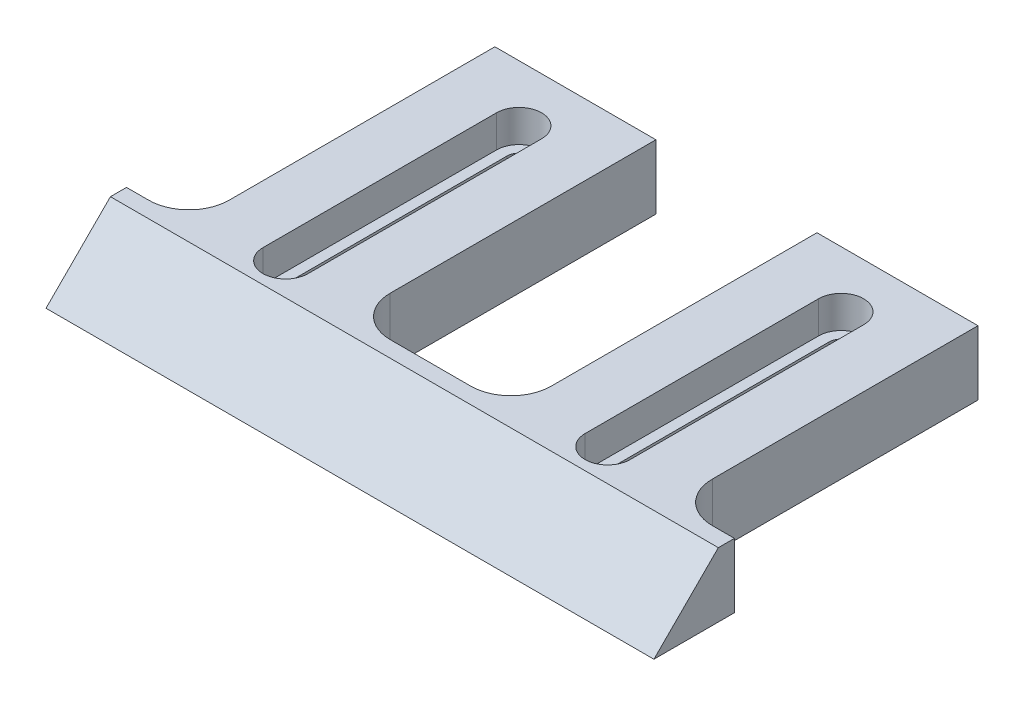
ISO-10303-21;
HEADER;
FILE_DESCRIPTION(('STEP AP214'),'2;1');
FILE_NAME('part.step','',(''),(''),'','','');
FILE_SCHEMA(('AUTOMOTIVE_DESIGN { 1 0 10303 214 1 1 1 1 }'));
ENDSEC;
DATA;
#1=APPLICATION_CONTEXT('core data for automotive mechanical design processes');
#2=APPLICATION_PROTOCOL_DEFINITION('international standard','automotive_design',2000,#1);
#3=PRODUCT_CONTEXT('',#1,'mechanical');
#4=PRODUCT('Part','Part','',(#3));
#5=PRODUCT_RELATED_PRODUCT_CATEGORY('part','',(#4));
#6=PRODUCT_DEFINITION_FORMATION('','',#4);
#7=PRODUCT_DEFINITION_CONTEXT('part definition',#1,'design');
#8=PRODUCT_DEFINITION('design','',#6,#7);
#9=PRODUCT_DEFINITION_SHAPE('','',#8);
#10=(LENGTH_UNIT() NAMED_UNIT(*) SI_UNIT(.MILLI.,.METRE.));
#11=(NAMED_UNIT(*) PLANE_ANGLE_UNIT() SI_UNIT($,.RADIAN.));
#12=(NAMED_UNIT(*) SI_UNIT($,.STERADIAN.) SOLID_ANGLE_UNIT());
#13=UNCERTAINTY_MEASURE_WITH_UNIT(LENGTH_MEASURE(1.E-05),#10,'distance_accuracy_value','');
#14=(GEOMETRIC_REPRESENTATION_CONTEXT(3) GLOBAL_UNCERTAINTY_ASSIGNED_CONTEXT((#13)) GLOBAL_UNIT_ASSIGNED_CONTEXT((#10,
#11,#12)) REPRESENTATION_CONTEXT('',''));
#15=CARTESIAN_POINT('',(0.,0.,0.));
#16=DIRECTION('',(0.,0.,1.));
#17=DIRECTION('',(1.,0.,0.));
#18=AXIS2_PLACEMENT_3D('',#15,#16,#17);
#19=CARTESIAN_POINT('',(57.75,-0.000999999999999265,-43.));
#20=DIRECTION('',(0.,1.,0.));
#21=DIRECTION('',(0.,0.,1.));
#22=AXIS2_PLACEMENT_3D('',#19,#20,#21);
#23=CYLINDRICAL_SURFACE('',#22,1.5);
#24=CARTESIAN_POINT('',(57.75,4.,-43.));
#25=DIRECTION('',(0.,1.,0.));
#26=DIRECTION('',(0.,0.,1.));
#27=AXIS2_PLACEMENT_3D('',#24,#25,#26);
#28=CIRCLE('',#27,1.5);
#29=CARTESIAN_POINT('',(56.25,4.,-43.));
#30=VERTEX_POINT('',#29);
#31=CARTESIAN_POINT('',(59.25,4.,-43.));
#32=VERTEX_POINT('',#31);
#33=EDGE_CURVE('E283',#30,#32,#28,.F.);
#34=ORIENTED_EDGE('',*,*,#33,.F.);
#35=DIRECTION('',(0.,1.,0.));
#36=VECTOR('',#35,1.);
#37=CARTESIAN_POINT('',(56.25,-0.000999999999999265,-43.));
#38=LINE('',#37,#36);
#39=CARTESIAN_POINT('',(56.25,0.,-43.));
#40=VERTEX_POINT('',#39);
#41=EDGE_CURVE('E366',#40,#30,#38,.T.);
#42=ORIENTED_EDGE('',*,*,#41,.F.);
#43=CARTESIAN_POINT('',(57.75,0.,-43.));
#44=DIRECTION('',(0.,-1.,0.));
#45=DIRECTION('',(0.,0.,-1.));
#46=AXIS2_PLACEMENT_3D('',#43,#44,#45);
#47=CIRCLE('',#46,1.5);
#48=CARTESIAN_POINT('',(59.25,0.,-43.));
#49=VERTEX_POINT('',#48);
#50=EDGE_CURVE('E363',#49,#40,#47,.F.);
#51=ORIENTED_EDGE('',*,*,#50,.F.);
#52=DIRECTION('',(0.,1.,0.));
#53=VECTOR('',#52,1.);
#54=CARTESIAN_POINT('',(59.25,-0.000999999999999265,-43.));
#55=LINE('',#54,#53);
#56=EDGE_CURVE('E367',#49,#32,#55,.T.);
#57=ORIENTED_EDGE('',*,*,#56,.T.);
#58=EDGE_LOOP('',(#34,#42,#51,#57));
#59=FACE_BOUND('',#58,.T.);
#60=ADVANCED_FACE('F34',(#59),#23,.F.);
#61=CARTESIAN_POINT('',(59.25,-0.000999999999999265,-43.));
#62=DIRECTION('',(1.,0.,0.));
#63=DIRECTION('',(0.,0.,-1.));
#64=AXIS2_PLACEMENT_3D('',#61,#62,#63);
#65=PLANE('',#64);
#66=DIRECTION('',(0.,0.,1.));
#67=VECTOR('',#66,1.);
#68=CARTESIAN_POINT('',(59.25,4.,-43.));
#69=LINE('',#68,#67);
#70=CARTESIAN_POINT('',(59.25,4.,-14.));
#71=VERTEX_POINT('',#70);
#72=EDGE_CURVE('E281',#32,#71,#69,.T.);
#73=ORIENTED_EDGE('',*,*,#72,.F.);
#74=ORIENTED_EDGE('',*,*,#56,.F.);
#75=DIRECTION('',(0.,0.,-1.));
#76=VECTOR('',#75,1.);
#77=CARTESIAN_POINT('',(59.25,0.,-43.));
#78=LINE('',#77,#76);
#79=CARTESIAN_POINT('',(59.25,0.,-14.));
#80=VERTEX_POINT('',#79);
#81=EDGE_CURVE('E360',#80,#49,#78,.T.);
#82=ORIENTED_EDGE('',*,*,#81,.F.);
#83=DIRECTION('',(0.,1.,0.));
#84=VECTOR('',#83,1.);
#85=CARTESIAN_POINT('',(59.25,-0.000999999999999265,-14.));
#86=LINE('',#85,#84);
#87=EDGE_CURVE('E371',#80,#71,#86,.T.);
#88=ORIENTED_EDGE('',*,*,#87,.T.);
#89=EDGE_LOOP('',(#73,#74,#82,#88));
#90=FACE_BOUND('',#89,.T.);
#91=ADVANCED_FACE('F514',(#90),#65,.F.);
#92=CARTESIAN_POINT('',(57.75,-0.000999999999999265,-14.));
#93=DIRECTION('',(0.,1.,0.));
#94=DIRECTION('',(0.,0.,1.));
#95=AXIS2_PLACEMENT_3D('',#92,#93,#94);
#96=CYLINDRICAL_SURFACE('',#95,1.5);
#97=CARTESIAN_POINT('',(57.75,4.,-14.));
#98=DIRECTION('',(0.,1.,0.));
#99=DIRECTION('',(0.,0.,1.));
#100=AXIS2_PLACEMENT_3D('',#97,#98,#99);
#101=CIRCLE('',#100,1.5);
#102=CARTESIAN_POINT('',(56.25,4.,-14.));
#103=VERTEX_POINT('',#102);
#104=EDGE_CURVE('E56',#71,#103,#101,.F.);
#105=ORIENTED_EDGE('',*,*,#104,.F.);
#106=ORIENTED_EDGE('',*,*,#87,.F.);
#107=CARTESIAN_POINT('',(57.75,0.,-14.));
#108=DIRECTION('',(0.,-1.,0.));
#109=DIRECTION('',(0.,0.,-1.));
#110=AXIS2_PLACEMENT_3D('',#107,#108,#109);
#111=CIRCLE('',#110,1.5);
#112=CARTESIAN_POINT('',(56.25,0.,-14.));
#113=VERTEX_POINT('',#112);
#114=EDGE_CURVE('E355',#113,#80,#111,.F.);
#115=ORIENTED_EDGE('',*,*,#114,.F.);
#116=DIRECTION('',(0.,1.,0.));
#117=VECTOR('',#116,1.);
#118=CARTESIAN_POINT('',(56.25,-0.000999999999999265,-14.));
#119=LINE('',#118,#117);
#120=EDGE_CURVE('E374',#113,#103,#119,.T.);
#121=ORIENTED_EDGE('',*,*,#120,.T.);
#122=EDGE_LOOP('',(#105,#106,#115,#121));
#123=FACE_BOUND('',#122,.T.);
#124=ADVANCED_FACE('F520',(#123),#96,.F.);
#125=CARTESIAN_POINT('',(56.25,-0.000999999999999265,-43.));
#126=DIRECTION('',(-1.,0.,0.));
#127=DIRECTION('',(0.,0.,1.));
#128=AXIS2_PLACEMENT_3D('',#125,#126,#127);
#129=PLANE('',#128);
#130=DIRECTION('',(0.,0.,-1.));
#131=VECTOR('',#130,1.);
#132=CARTESIAN_POINT('',(56.25,4.,-43.));
#133=LINE('',#132,#131);
#134=EDGE_CURVE('E11',#103,#30,#133,.T.);
#135=ORIENTED_EDGE('',*,*,#134,.F.);
#136=ORIENTED_EDGE('',*,*,#120,.F.);
#137=DIRECTION('',(0.,0.,1.));
#138=VECTOR('',#137,1.);
#139=CARTESIAN_POINT('',(56.25,0.,-43.));
#140=LINE('',#139,#138);
#141=EDGE_CURVE('E370',#40,#113,#140,.T.);
#142=ORIENTED_EDGE('',*,*,#141,.F.);
#143=ORIENTED_EDGE('',*,*,#41,.T.);
#144=EDGE_LOOP('',(#135,#136,#142,#143));
#145=FACE_BOUND('',#144,.T.);
#146=ADVANCED_FACE('F525',(#145),#129,.F.);
#147=CARTESIAN_POINT('',(17.75,-0.000999999999999265,-43.));
#148=DIRECTION('',(0.,1.,0.));
#149=DIRECTION('',(0.,0.,1.));
#150=AXIS2_PLACEMENT_3D('',#147,#148,#149);
#151=CYLINDRICAL_SURFACE('',#150,1.5);
#152=CARTESIAN_POINT('',(17.75,4.,-43.));
#153=DIRECTION('',(0.,1.,0.));
#154=DIRECTION('',(0.,0.,1.));
#155=AXIS2_PLACEMENT_3D('',#152,#153,#154);
#156=CIRCLE('',#155,1.5);
#157=CARTESIAN_POINT('',(16.25,4.,-43.));
#158=VERTEX_POINT('',#157);
#159=CARTESIAN_POINT('',(19.25,4.,-43.));
#160=VERTEX_POINT('',#159);
#161=EDGE_CURVE('E321',#158,#160,#156,.F.);
#162=ORIENTED_EDGE('',*,*,#161,.F.);
#163=DIRECTION('',(0.,1.,0.));
#164=VECTOR('',#163,1.);
#165=CARTESIAN_POINT('',(16.25,-0.000999999999999265,-43.));
#166=LINE('',#165,#164);
#167=CARTESIAN_POINT('',(16.25,0.,-43.));
#168=VERTEX_POINT('',#167);
#169=EDGE_CURVE('E390',#168,#158,#166,.T.);
#170=ORIENTED_EDGE('',*,*,#169,.F.);
#171=CARTESIAN_POINT('',(17.75,0.,-43.));
#172=DIRECTION('',(0.,-1.,0.));
#173=DIRECTION('',(0.,0.,-1.));
#174=AXIS2_PLACEMENT_3D('',#171,#172,#173);
#175=CIRCLE('',#174,1.5);
#176=CARTESIAN_POINT('',(19.25,0.,-43.));
#177=VERTEX_POINT('',#176);
#178=EDGE_CURVE('E387',#177,#168,#175,.F.);
#179=ORIENTED_EDGE('',*,*,#178,.F.);
#180=DIRECTION('',(0.,1.,0.));
#181=VECTOR('',#180,1.);
#182=CARTESIAN_POINT('',(19.25,-0.000999999999999265,-43.));
#183=LINE('',#182,#181);
#184=EDGE_CURVE('E391',#177,#160,#183,.T.);
#185=ORIENTED_EDGE('',*,*,#184,.T.);
#186=EDGE_LOOP('',(#162,#170,#179,#185));
#187=FACE_BOUND('',#186,.T.);
#188=ADVANCED_FACE('F493',(#187),#151,.F.);
#189=CARTESIAN_POINT('',(19.25,-0.000999999999999265,-43.));
#190=DIRECTION('',(1.,0.,0.));
#191=DIRECTION('',(0.,0.,-1.));
#192=AXIS2_PLACEMENT_3D('',#189,#190,#191);
#193=PLANE('',#192);
#194=DIRECTION('',(0.,0.,1.));
#195=VECTOR('',#194,1.);
#196=CARTESIAN_POINT('',(19.25,4.,-43.));
#197=LINE('',#196,#195);
#198=CARTESIAN_POINT('',(19.25,4.,-14.));
#199=VERTEX_POINT('',#198);
#200=EDGE_CURVE('E319',#160,#199,#197,.T.);
#201=ORIENTED_EDGE('',*,*,#200,.F.);
#202=ORIENTED_EDGE('',*,*,#184,.F.);
#203=DIRECTION('',(0.,0.,-1.));
#204=VECTOR('',#203,1.);
#205=CARTESIAN_POINT('',(19.25,0.,-43.));
#206=LINE('',#205,#204);
#207=CARTESIAN_POINT('',(19.25,0.,-14.));
#208=VERTEX_POINT('',#207);
#209=EDGE_CURVE('E384',#208,#177,#206,.T.);
#210=ORIENTED_EDGE('',*,*,#209,.F.);
#211=DIRECTION('',(0.,1.,0.));
#212=VECTOR('',#211,1.);
#213=CARTESIAN_POINT('',(19.25,-0.000999999999999265,-14.));
#214=LINE('',#213,#212);
#215=EDGE_CURVE('E395',#208,#199,#214,.T.);
#216=ORIENTED_EDGE('',*,*,#215,.T.);
#217=EDGE_LOOP('',(#201,#202,#210,#216));
#218=FACE_BOUND('',#217,.T.);
#219=ADVANCED_FACE('F500',(#218),#193,.F.);
#220=CARTESIAN_POINT('',(17.75,-0.000999999999999265,-14.));
#221=DIRECTION('',(0.,1.,0.));
#222=DIRECTION('',(0.,0.,1.));
#223=AXIS2_PLACEMENT_3D('',#220,#221,#222);
#224=CYLINDRICAL_SURFACE('',#223,1.5);
#225=CARTESIAN_POINT('',(17.75,4.,-14.));
#226=DIRECTION('',(0.,1.,0.));
#227=DIRECTION('',(0.,0.,1.));
#228=AXIS2_PLACEMENT_3D('',#225,#226,#227);
#229=CIRCLE('',#228,1.5);
#230=CARTESIAN_POINT('',(16.25,4.,-14.));
#231=VERTEX_POINT('',#230);
#232=EDGE_CURVE('E311',#199,#231,#229,.F.);
#233=ORIENTED_EDGE('',*,*,#232,.F.);
#234=ORIENTED_EDGE('',*,*,#215,.F.);
#235=CARTESIAN_POINT('',(17.75,0.,-14.));
#236=DIRECTION('',(0.,-1.,0.));
#237=DIRECTION('',(0.,0.,-1.));
#238=AXIS2_PLACEMENT_3D('',#235,#236,#237);
#239=CIRCLE('',#238,1.5);
#240=CARTESIAN_POINT('',(16.25,0.,-14.));
#241=VERTEX_POINT('',#240);
#242=EDGE_CURVE('E381',#241,#208,#239,.F.);
#243=ORIENTED_EDGE('',*,*,#242,.F.);
#244=DIRECTION('',(0.,1.,0.));
#245=VECTOR('',#244,1.);
#246=CARTESIAN_POINT('',(16.25,-0.000999999999999265,-14.));
#247=LINE('',#246,#245);
#248=EDGE_CURVE('E398',#241,#231,#247,.T.);
#249=ORIENTED_EDGE('',*,*,#248,.T.);
#250=EDGE_LOOP('',(#233,#234,#243,#249));
#251=FACE_BOUND('',#250,.T.);
#252=ADVANCED_FACE('F503',(#251),#224,.F.);
#253=CARTESIAN_POINT('',(16.25,-0.000999999999999265,-43.));
#254=DIRECTION('',(-1.,0.,0.));
#255=DIRECTION('',(0.,0.,1.));
#256=AXIS2_PLACEMENT_3D('',#253,#254,#255);
#257=PLANE('',#256);
#258=DIRECTION('',(0.,0.,-1.));
#259=VECTOR('',#258,1.);
#260=CARTESIAN_POINT('',(16.25,4.,-43.));
#261=LINE('',#260,#259);
#262=EDGE_CURVE('E42',#231,#158,#261,.T.);
#263=ORIENTED_EDGE('',*,*,#262,.F.);
#264=ORIENTED_EDGE('',*,*,#248,.F.);
#265=DIRECTION('',(0.,0.,1.));
#266=VECTOR('',#265,1.);
#267=CARTESIAN_POINT('',(16.25,0.,-43.));
#268=LINE('',#267,#266);
#269=EDGE_CURVE('E394',#168,#241,#268,.T.);
#270=ORIENTED_EDGE('',*,*,#269,.F.);
#271=ORIENTED_EDGE('',*,*,#169,.T.);
#272=EDGE_LOOP('',(#263,#264,#270,#271));
#273=FACE_BOUND('',#272,.T.);
#274=ADVANCED_FACE('F495',(#273),#257,.F.);
#275=CARTESIAN_POINT('',(0.,8.,-50.));
#276=DIRECTION('',(0.,0.,1.));
#277=DIRECTION('',(1.,0.,0.));
#278=AXIS2_PLACEMENT_3D('',#275,#276,#277);
#279=PLANE('',#278);
#280=DIRECTION('',(-1.,0.,0.));
#281=VECTOR('',#280,1.);
#282=CARTESIAN_POINT('',(0.,0.,-50.));
#283=LINE('',#282,#281);
#284=CARTESIAN_POINT('',(27.75,0.,-50.));
#285=VERTEX_POINT('',#284);
#286=CARTESIAN_POINT('',(7.75,0.,-50.));
#287=VERTEX_POINT('',#286);
#288=EDGE_CURVE('E418',#285,#287,#283,.T.);
#289=ORIENTED_EDGE('',*,*,#288,.T.);
#290=DIRECTION('',(0.,1.,0.));
#291=VECTOR('',#290,1.);
#292=CARTESIAN_POINT('',(7.75,-2.,-50.));
#293=LINE('',#292,#291);
#294=CARTESIAN_POINT('',(7.75,8.,-50.));
#295=VERTEX_POINT('',#294);
#296=EDGE_CURVE('E340',#287,#295,#293,.T.);
#297=ORIENTED_EDGE('',*,*,#296,.T.);
#298=DIRECTION('',(-1.,0.,0.));
#299=VECTOR('',#298,1.);
#300=CARTESIAN_POINT('',(0.,8.,-50.));
#301=LINE('',#300,#299);
#302=CARTESIAN_POINT('',(27.75,8.,-50.));
#303=VERTEX_POINT('',#302);
#304=EDGE_CURVE('E408',#303,#295,#301,.T.);
#305=ORIENTED_EDGE('',*,*,#304,.F.);
#306=DIRECTION('',(0.,1.,0.));
#307=VECTOR('',#306,1.);
#308=CARTESIAN_POINT('',(27.75,-2.,-50.));
#309=LINE('',#308,#307);
#310=EDGE_CURVE('E353',#285,#303,#309,.T.);
#311=ORIENTED_EDGE('',*,*,#310,.F.);
#312=EDGE_LOOP('',(#289,#297,#305,#311));
#313=FACE_BOUND('',#312,.T.);
#314=ADVANCED_FACE('F510',(#313),#279,.F.);
#315=CARTESIAN_POINT('',(75.5,8.,-50.));
#316=DIRECTION('',(-1.,0.,0.));
#317=DIRECTION('',(0.,0.,1.));
#318=AXIS2_PLACEMENT_3D('',#315,#316,#317);
#319=PLANE('',#318);
#320=DIRECTION('',(0.,0.,-1.));
#321=VECTOR('',#320,1.);
#322=CARTESIAN_POINT('',(75.5,8.,-50.));
#323=LINE('',#322,#321);
#324=CARTESIAN_POINT('',(75.5,8.,-10.0000000000002));
#325=VERTEX_POINT('',#324);
#326=CARTESIAN_POINT('',(75.5,8.,-12.));
#327=VERTEX_POINT('',#326);
#328=EDGE_CURVE('E406',#325,#327,#323,.T.);
#329=ORIENTED_EDGE('',*,*,#328,.F.);
#330=DIRECTION('',(0.,0.707106781186544,-0.707106781186551));
#331=VECTOR('',#330,1.);
#332=CARTESIAN_POINT('',(75.5,8.00000000000015,-10.0000000000003));
#333=LINE('',#332,#331);
#334=CARTESIAN_POINT('',(75.5,0.,-2.00000000000024));
#335=VERTEX_POINT('',#334);
#336=EDGE_CURVE('E479',#325,#335,#333,.F.);
#337=ORIENTED_EDGE('',*,*,#336,.T.);
#338=DIRECTION('',(0.,0.,-1.));
#339=VECTOR('',#338,1.);
#340=CARTESIAN_POINT('',(75.5,0.,-50.));
#341=LINE('',#340,#339);
#342=CARTESIAN_POINT('',(75.5,0.,-12.));
#343=VERTEX_POINT('',#342);
#344=EDGE_CURVE('E405',#335,#343,#341,.T.);
#345=ORIENTED_EDGE('',*,*,#344,.T.);
#346=DIRECTION('',(0.,1.,0.));
#347=VECTOR('',#346,1.);
#348=CARTESIAN_POINT('',(75.5,-2.,-12.));
#349=LINE('',#348,#347);
#350=EDGE_CURVE('E329',#343,#327,#349,.T.);
#351=ORIENTED_EDGE('',*,*,#350,.T.);
#352=EDGE_LOOP('',(#329,#337,#345,#351));
#353=FACE_BOUND('',#352,.T.);
#354=ADVANCED_FACE('F775',(#353),#319,.F.);
#355=CARTESIAN_POINT('',(67.75,8.,-50.));
#356=VERTEX_POINT('',#355);
#357=CARTESIAN_POINT('',(47.75,8.,-50.));
#358=VERTEX_POINT('',#357);
#359=EDGE_CURVE('E410',#356,#358,#301,.T.);
#360=ORIENTED_EDGE('',*,*,#359,.F.);
#361=DIRECTION('',(0.,1.,0.));
#362=VECTOR('',#361,1.);
#363=CARTESIAN_POINT('',(67.75,-2.,-50.));
#364=LINE('',#363,#362);
#365=CARTESIAN_POINT('',(67.75,0.,-50.));
#366=VERTEX_POINT('',#365);
#367=EDGE_CURVE('E330',#366,#356,#364,.T.);
#368=ORIENTED_EDGE('',*,*,#367,.F.);
#369=CARTESIAN_POINT('',(47.75,0.,-50.));
#370=VERTEX_POINT('',#369);
#371=EDGE_CURVE('E419',#366,#370,#283,.T.);
#372=ORIENTED_EDGE('',*,*,#371,.T.);
#373=DIRECTION('',(0.,1.,0.));
#374=VECTOR('',#373,1.);
#375=CARTESIAN_POINT('',(47.75,-2.,-50.));
#376=LINE('',#375,#374);
#377=EDGE_CURVE('E352',#370,#358,#376,.T.);
#378=ORIENTED_EDGE('',*,*,#377,.T.);
#379=EDGE_LOOP('',(#360,#368,#372,#378));
#380=FACE_BOUND('',#379,.T.);
#381=ADVANCED_FACE('F778',(#380),#279,.F.);
#382=CARTESIAN_POINT('',(0.,8.,0.));
#383=DIRECTION('',(1.,0.,0.));
#384=DIRECTION('',(0.,0.,-1.));
#385=AXIS2_PLACEMENT_3D('',#382,#383,#384);
#386=PLANE('',#385);
#387=DIRECTION('',(0.,0.,1.));
#388=VECTOR('',#387,1.);
#389=CARTESIAN_POINT('',(0.,0.,0.));
#390=LINE('',#389,#388);
#391=CARTESIAN_POINT('',(0.,0.,-12.));
#392=VERTEX_POINT('',#391);
#393=CARTESIAN_POINT('',(0.,0.,-2.00000000000037));
#394=VERTEX_POINT('',#393);
#395=EDGE_CURVE('E409',#392,#394,#390,.T.);
#396=ORIENTED_EDGE('',*,*,#395,.T.);
#397=DIRECTION('',(0.,-0.707106781186544,0.707106781186551));
#398=VECTOR('',#397,1.);
#399=CARTESIAN_POINT('',(0.,8.,-10.0000000000005));
#400=LINE('',#399,#398);
#401=CARTESIAN_POINT('',(0.,8.,-10.0000000000005));
#402=VERTEX_POINT('',#401);
#403=EDGE_CURVE('E483',#394,#402,#400,.F.);
#404=ORIENTED_EDGE('',*,*,#403,.T.);
#405=DIRECTION('',(0.,0.,1.));
#406=VECTOR('',#405,1.);
#407=CARTESIAN_POINT('',(0.,8.,0.));
#408=LINE('',#407,#406);
#409=CARTESIAN_POINT('',(0.,8.,-12.));
#410=VERTEX_POINT('',#409);
#411=EDGE_CURVE('E413',#410,#402,#408,.T.);
#412=ORIENTED_EDGE('',*,*,#411,.F.);
#413=DIRECTION('',(0.,1.,0.));
#414=VECTOR('',#413,1.);
#415=CARTESIAN_POINT('',(0.,-2.,-12.));
#416=LINE('',#415,#414);
#417=EDGE_CURVE('E339',#392,#410,#416,.T.);
#418=ORIENTED_EDGE('',*,*,#417,.F.);
#419=EDGE_LOOP('',(#396,#404,#412,#418));
#420=FACE_BOUND('',#419,.T.);
#421=ADVANCED_FACE('F793',(#420),#386,.F.);
#422=CARTESIAN_POINT('',(0.,8.,0.));
#423=DIRECTION('',(0.,-1.,0.));
#424=DIRECTION('',(0.,0.,-1.));
#425=AXIS2_PLACEMENT_3D('',#422,#423,#424);
#426=PLANE('',#425);
#427=DIRECTION('',(0.,0.,1.));
#428=VECTOR('',#427,1.);
#429=CARTESIAN_POINT('',(54.95,8.,-43.));
#430=LINE('',#429,#428);
#431=CARTESIAN_POINT('',(54.95,8.,-43.));
#432=VERTEX_POINT('',#431);
#433=CARTESIAN_POINT('',(54.95,8.,-14.));
#434=VERTEX_POINT('',#433);
#435=EDGE_CURVE('E271',#432,#434,#430,.T.);
#436=ORIENTED_EDGE('',*,*,#435,.F.);
#437=CARTESIAN_POINT('',(57.75,8.,-43.));
#438=DIRECTION('',(0.,1.,0.));
#439=DIRECTION('',(0.,0.,1.));
#440=AXIS2_PLACEMENT_3D('',#437,#438,#439);
#441=CIRCLE('',#440,2.80000000000001);
#442=CARTESIAN_POINT('',(60.55,8.,-43.));
#443=VERTEX_POINT('',#442);
#444=EDGE_CURVE('E49',#443,#432,#441,.T.);
#445=ORIENTED_EDGE('',*,*,#444,.F.);
#446=DIRECTION('',(0.,0.,-1.));
#447=VECTOR('',#446,1.);
#448=CARTESIAN_POINT('',(60.55,8.,-43.));
#449=LINE('',#448,#447);
#450=CARTESIAN_POINT('',(60.55,8.,-14.));
#451=VERTEX_POINT('',#450);
#452=EDGE_CURVE('E262',#451,#443,#449,.T.);
#453=ORIENTED_EDGE('',*,*,#452,.F.);
#454=CARTESIAN_POINT('',(57.75,8.,-14.));
#455=DIRECTION('',(0.,1.,0.));
#456=DIRECTION('',(0.,0.,1.));
#457=AXIS2_PLACEMENT_3D('',#454,#455,#456);
#458=CIRCLE('',#457,2.80000000000001);
#459=EDGE_CURVE('E265',#434,#451,#458,.T.);
#460=ORIENTED_EDGE('',*,*,#459,.F.);
#461=EDGE_LOOP('',(#436,#445,#453,#460));
#462=FACE_BOUND('',#461,.T.);
#463=DIRECTION('',(0.,0.,1.));
#464=VECTOR('',#463,1.);
#465=CARTESIAN_POINT('',(14.95,8.,-43.));
#466=LINE('',#465,#464);
#467=CARTESIAN_POINT('',(14.95,8.,-43.));
#468=VERTEX_POINT('',#467);
#469=CARTESIAN_POINT('',(14.95,8.,-14.));
#470=VERTEX_POINT('',#469);
#471=EDGE_CURVE('E301',#468,#470,#466,.T.);
#472=ORIENTED_EDGE('',*,*,#471,.F.);
#473=CARTESIAN_POINT('',(17.75,8.,-43.));
#474=DIRECTION('',(0.,1.,0.));
#475=DIRECTION('',(0.,0.,1.));
#476=AXIS2_PLACEMENT_3D('',#473,#474,#475);
#477=CIRCLE('',#476,2.8);
#478=CARTESIAN_POINT('',(20.55,8.,-43.));
#479=VERTEX_POINT('',#478);
#480=EDGE_CURVE('E285',#479,#468,#477,.T.);
#481=ORIENTED_EDGE('',*,*,#480,.F.);
#482=DIRECTION('',(0.,0.,-1.));
#483=VECTOR('',#482,1.);
#484=CARTESIAN_POINT('',(20.55,8.,-43.));
#485=LINE('',#484,#483);
#486=CARTESIAN_POINT('',(20.55,8.,-14.));
#487=VERTEX_POINT('',#486);
#488=EDGE_CURVE('E290',#487,#479,#485,.T.);
#489=ORIENTED_EDGE('',*,*,#488,.F.);
#490=CARTESIAN_POINT('',(17.75,8.,-14.));
#491=DIRECTION('',(0.,1.,0.));
#492=DIRECTION('',(0.,0.,1.));
#493=AXIS2_PLACEMENT_3D('',#490,#491,#492);
#494=CIRCLE('',#493,2.79999999999999);
#495=EDGE_CURVE('E304',#470,#487,#494,.T.);
#496=ORIENTED_EDGE('',*,*,#495,.F.);
#497=EDGE_LOOP('',(#472,#481,#489,#496));
#498=FACE_BOUND('',#497,.T.);
#499=ORIENTED_EDGE('',*,*,#411,.T.);
#500=DIRECTION('',(1.,0.,0.));
#501=VECTOR('',#500,1.);
#502=CARTESIAN_POINT('',(0.,8.,-10.0000000000005));
#503=LINE('',#502,#501);
#504=EDGE_CURVE('E476',#402,#325,#503,.T.);
#505=ORIENTED_EDGE('',*,*,#504,.T.);
#506=ORIENTED_EDGE('',*,*,#328,.T.);
#507=DIRECTION('',(1.,0.,0.));
#508=VECTOR('',#507,1.);
#509=CARTESIAN_POINT('',(67.75,8.,-12.));
#510=LINE('',#509,#508);
#511=CARTESIAN_POINT('',(72.75,8.,-12.));
#512=VERTEX_POINT('',#511);
#513=EDGE_CURVE('E326',#512,#327,#510,.T.);
#514=ORIENTED_EDGE('',*,*,#513,.F.);
#515=CARTESIAN_POINT('',(72.75,8.,-17.));
#516=DIRECTION('',(0.,-1.,0.));
#517=DIRECTION('',(0.,0.,-1.));
#518=AXIS2_PLACEMENT_3D('',#515,#516,#517);
#519=CIRCLE('',#518,5.);
#520=CARTESIAN_POINT('',(67.75,8.,-17.));
#521=VERTEX_POINT('',#520);
#522=EDGE_CURVE('E460',#512,#521,#519,.T.);
#523=ORIENTED_EDGE('',*,*,#522,.T.);
#524=DIRECTION('',(0.,0.,1.));
#525=VECTOR('',#524,1.);
#526=CARTESIAN_POINT('',(67.75,8.,-50.));
#527=LINE('',#526,#525);
#528=EDGE_CURVE('E323',#356,#521,#527,.T.);
#529=ORIENTED_EDGE('',*,*,#528,.F.);
#530=ORIENTED_EDGE('',*,*,#359,.T.);
#531=DIRECTION('',(0.,0.,-1.));
#532=VECTOR('',#531,1.);
#533=CARTESIAN_POINT('',(47.75,8.,-50.));
#534=LINE('',#533,#532);
#535=CARTESIAN_POINT('',(47.75,8.,-17.));
#536=VERTEX_POINT('',#535);
#537=EDGE_CURVE('E350',#536,#358,#534,.T.);
#538=ORIENTED_EDGE('',*,*,#537,.F.);
#539=CARTESIAN_POINT('',(42.75,8.,-17.));
#540=DIRECTION('',(0.,-1.,0.));
#541=DIRECTION('',(0.,0.,-1.));
#542=AXIS2_PLACEMENT_3D('',#539,#540,#541);
#543=CIRCLE('',#542,5.);
#544=CARTESIAN_POINT('',(42.75,8.,-12.));
#545=VERTEX_POINT('',#544);
#546=EDGE_CURVE('E464',#536,#545,#543,.T.);
#547=ORIENTED_EDGE('',*,*,#546,.T.);
#548=DIRECTION('',(1.,0.,0.));
#549=VECTOR('',#548,1.);
#550=CARTESIAN_POINT('',(27.75,8.,-12.));
#551=LINE('',#550,#549);
#552=CARTESIAN_POINT('',(32.75,8.,-12.));
#553=VERTEX_POINT('',#552);
#554=EDGE_CURVE('E347',#553,#545,#551,.T.);
#555=ORIENTED_EDGE('',*,*,#554,.F.);
#556=CARTESIAN_POINT('',(32.75,8.,-17.));
#557=DIRECTION('',(0.,-1.,0.));
#558=DIRECTION('',(0.,0.,-1.));
#559=AXIS2_PLACEMENT_3D('',#556,#557,#558);
#560=CIRCLE('',#559,5.);
#561=CARTESIAN_POINT('',(27.75,8.,-17.));
#562=VERTEX_POINT('',#561);
#563=EDGE_CURVE('E468',#553,#562,#560,.T.);
#564=ORIENTED_EDGE('',*,*,#563,.T.);
#565=DIRECTION('',(0.,0.,1.));
#566=VECTOR('',#565,1.);
#567=CARTESIAN_POINT('',(27.75,8.,-50.));
#568=LINE('',#567,#566);
#569=EDGE_CURVE('E343',#303,#562,#568,.T.);
#570=ORIENTED_EDGE('',*,*,#569,.F.);
#571=ORIENTED_EDGE('',*,*,#304,.T.);
#572=DIRECTION('',(0.,0.,-1.));
#573=VECTOR('',#572,1.);
#574=CARTESIAN_POINT('',(7.75,8.,-50.));
#575=LINE('',#574,#573);
#576=CARTESIAN_POINT('',(7.75,8.,-17.));
#577=VERTEX_POINT('',#576);
#578=EDGE_CURVE('E337',#577,#295,#575,.T.);
#579=ORIENTED_EDGE('',*,*,#578,.F.);
#580=CARTESIAN_POINT('',(2.75,8.,-17.));
#581=DIRECTION('',(0.,-1.,0.));
#582=DIRECTION('',(0.,0.,-1.));
#583=AXIS2_PLACEMENT_3D('',#580,#581,#582);
#584=CIRCLE('',#583,5.);
#585=CARTESIAN_POINT('',(2.75,8.,-12.));
#586=VERTEX_POINT('',#585);
#587=EDGE_CURVE('E472',#577,#586,#584,.T.);
#588=ORIENTED_EDGE('',*,*,#587,.T.);
#589=DIRECTION('',(1.,0.,0.));
#590=VECTOR('',#589,1.);
#591=CARTESIAN_POINT('',(0.,8.,-12.));
#592=LINE('',#591,#590);
#593=EDGE_CURVE('E332',#410,#586,#592,.T.);
#594=ORIENTED_EDGE('',*,*,#593,.F.);
#595=EDGE_LOOP('',(#499,#505,#506,#514,#523,#529,#530,#538,#547,#555,#564,#570,#571,#579,#588,#594));
#596=FACE_BOUND('',#595,.T.);
#597=ADVANCED_FACE('F784',(#462,#498,#596),#426,.F.);
#598=CARTESIAN_POINT('',(0.,0.,0.));
#599=DIRECTION('',(0.,-1.,0.));
#600=DIRECTION('',(0.,0.,-1.));
#601=AXIS2_PLACEMENT_3D('',#598,#599,#600);
#602=PLANE('',#601);
#603=ORIENTED_EDGE('',*,*,#344,.F.);
#604=DIRECTION('',(1.,0.,0.));
#605=VECTOR('',#604,1.);
#606=CARTESIAN_POINT('',(0.,0.,-2.00000000000038));
#607=LINE('',#606,#605);
#608=EDGE_CURVE('E481',#335,#394,#607,.F.);
#609=ORIENTED_EDGE('',*,*,#608,.T.);
#610=ORIENTED_EDGE('',*,*,#395,.F.);
#611=DIRECTION('',(-1.,0.,0.));
#612=VECTOR('',#611,1.);
#613=CARTESIAN_POINT('',(0.,0.,-12.));
#614=LINE('',#613,#612);
#615=CARTESIAN_POINT('',(2.75,0.,-12.));
#616=VERTEX_POINT('',#615);
#617=EDGE_CURVE('E430',#616,#392,#614,.T.);
#618=ORIENTED_EDGE('',*,*,#617,.F.);
#619=CARTESIAN_POINT('',(2.75,0.,-17.));
#620=DIRECTION('',(0.,-1.,0.));
#621=DIRECTION('',(0.,0.,-1.));
#622=AXIS2_PLACEMENT_3D('',#619,#620,#621);
#623=CIRCLE('',#622,5.);
#624=CARTESIAN_POINT('',(7.75,0.,-17.));
#625=VERTEX_POINT('',#624);
#626=EDGE_CURVE('E474',#616,#625,#623,.F.);
#627=ORIENTED_EDGE('',*,*,#626,.T.);
#628=DIRECTION('',(0.,0.,1.));
#629=VECTOR('',#628,1.);
#630=CARTESIAN_POINT('',(7.75000000000001,0.,0.));
#631=LINE('',#630,#629);
#632=EDGE_CURVE('E432',#287,#625,#631,.T.);
#633=ORIENTED_EDGE('',*,*,#632,.F.);
#634=ORIENTED_EDGE('',*,*,#288,.F.);
#635=DIRECTION('',(0.,0.,-1.));
#636=VECTOR('',#635,1.);
#637=CARTESIAN_POINT('',(27.75,0.,0.));
#638=LINE('',#637,#636);
#639=CARTESIAN_POINT('',(27.75,0.,-17.));
#640=VERTEX_POINT('',#639);
#641=EDGE_CURVE('E428',#640,#285,#638,.T.);
#642=ORIENTED_EDGE('',*,*,#641,.F.);
#643=CARTESIAN_POINT('',(32.75,0.,-17.));
#644=DIRECTION('',(0.,-1.,0.));
#645=DIRECTION('',(0.,0.,-1.));
#646=AXIS2_PLACEMENT_3D('',#643,#644,#645);
#647=CIRCLE('',#646,5.);
#648=CARTESIAN_POINT('',(32.75,0.,-12.));
#649=VERTEX_POINT('',#648);
#650=EDGE_CURVE('E470',#640,#649,#647,.F.);
#651=ORIENTED_EDGE('',*,*,#650,.T.);
#652=DIRECTION('',(-1.,0.,0.));
#653=VECTOR('',#652,1.);
#654=CARTESIAN_POINT('',(0.,0.,-12.));
#655=LINE('',#654,#653);
#656=CARTESIAN_POINT('',(42.75,0.,-12.));
#657=VERTEX_POINT('',#656);
#658=EDGE_CURVE('E416',#657,#649,#655,.T.);
#659=ORIENTED_EDGE('',*,*,#658,.F.);
#660=CARTESIAN_POINT('',(42.75,0.,-17.));
#661=DIRECTION('',(0.,-1.,0.));
#662=DIRECTION('',(0.,0.,-1.));
#663=AXIS2_PLACEMENT_3D('',#660,#661,#662);
#664=CIRCLE('',#663,5.);
#665=CARTESIAN_POINT('',(47.75,0.,-17.));
#666=VERTEX_POINT('',#665);
#667=EDGE_CURVE('E466',#657,#666,#664,.F.);
#668=ORIENTED_EDGE('',*,*,#667,.T.);
#669=DIRECTION('',(0.,0.,1.));
#670=VECTOR('',#669,1.);
#671=CARTESIAN_POINT('',(47.75,0.,0.));
#672=LINE('',#671,#670);
#673=EDGE_CURVE('E425',#370,#666,#672,.T.);
#674=ORIENTED_EDGE('',*,*,#673,.F.);
#675=ORIENTED_EDGE('',*,*,#371,.F.);
#676=DIRECTION('',(0.,0.,-1.));
#677=VECTOR('',#676,1.);
#678=CARTESIAN_POINT('',(67.75,0.,0.));
#679=LINE('',#678,#677);
#680=CARTESIAN_POINT('',(67.75,0.,-17.));
#681=VERTEX_POINT('',#680);
#682=EDGE_CURVE('E438',#681,#366,#679,.T.);
#683=ORIENTED_EDGE('',*,*,#682,.F.);
#684=CARTESIAN_POINT('',(72.75,0.,-17.));
#685=DIRECTION('',(0.,-1.,0.));
#686=DIRECTION('',(0.,0.,-1.));
#687=AXIS2_PLACEMENT_3D('',#684,#685,#686);
#688=CIRCLE('',#687,5.);
#689=CARTESIAN_POINT('',(72.75,0.,-12.));
#690=VERTEX_POINT('',#689);
#691=EDGE_CURVE('E462',#681,#690,#688,.F.);
#692=ORIENTED_EDGE('',*,*,#691,.T.);
#693=DIRECTION('',(-1.,0.,0.));
#694=VECTOR('',#693,1.);
#695=CARTESIAN_POINT('',(0.,0.,-12.));
#696=LINE('',#695,#694);
#697=EDGE_CURVE('E435',#343,#690,#696,.T.);
#698=ORIENTED_EDGE('',*,*,#697,.F.);
#699=EDGE_LOOP('',(#603,#609,#610,#618,#627,#633,#634,#642,#651,#659,#668,#674,#675,#683,#692,#698));
#700=FACE_BOUND('',#699,.T.);
#701=ORIENTED_EDGE('',*,*,#50,.T.);
#702=ORIENTED_EDGE('',*,*,#141,.T.);
#703=ORIENTED_EDGE('',*,*,#114,.T.);
#704=ORIENTED_EDGE('',*,*,#81,.T.);
#705=EDGE_LOOP('',(#701,#702,#703,#704));
#706=FACE_BOUND('',#705,.T.);
#707=ORIENTED_EDGE('',*,*,#178,.T.);
#708=ORIENTED_EDGE('',*,*,#269,.T.);
#709=ORIENTED_EDGE('',*,*,#242,.T.);
#710=ORIENTED_EDGE('',*,*,#209,.T.);
#711=EDGE_LOOP('',(#707,#708,#709,#710));
#712=FACE_BOUND('',#711,.T.);
#713=ADVANCED_FACE('F498',(#700,#706,#712),#602,.T.);
#714=CARTESIAN_POINT('',(27.75,-2.,-50.));
#715=DIRECTION('',(-1.,0.,0.));
#716=DIRECTION('',(0.,0.,1.));
#717=AXIS2_PLACEMENT_3D('',#714,#715,#716);
#718=PLANE('',#717);
#719=ORIENTED_EDGE('',*,*,#569,.T.);
#720=DIRECTION('',(0.,1.,0.));
#721=VECTOR('',#720,1.);
#722=CARTESIAN_POINT('',(27.75,0.,-17.));
#723=LINE('',#722,#721);
#724=EDGE_CURVE('E453',#562,#640,#723,.F.);
#725=ORIENTED_EDGE('',*,*,#724,.T.);
#726=ORIENTED_EDGE('',*,*,#641,.T.);
#727=ORIENTED_EDGE('',*,*,#310,.T.);
#728=EDGE_LOOP('',(#719,#725,#726,#727));
#729=FACE_BOUND('',#728,.T.);
#730=ADVANCED_FACE('F532',(#729),#718,.F.);
#731=CARTESIAN_POINT('',(47.75,-2.,-50.));
#732=DIRECTION('',(1.,0.,0.));
#733=DIRECTION('',(0.,0.,-1.));
#734=AXIS2_PLACEMENT_3D('',#731,#732,#733);
#735=PLANE('',#734);
#736=ORIENTED_EDGE('',*,*,#673,.T.);
#737=DIRECTION('',(0.,1.,0.));
#738=VECTOR('',#737,1.);
#739=CARTESIAN_POINT('',(47.75,8.,-17.));
#740=LINE('',#739,#738);
#741=EDGE_CURVE('E445',#666,#536,#740,.T.);
#742=ORIENTED_EDGE('',*,*,#741,.T.);
#743=ORIENTED_EDGE('',*,*,#537,.T.);
#744=ORIENTED_EDGE('',*,*,#377,.F.);
#745=EDGE_LOOP('',(#736,#742,#743,#744));
#746=FACE_BOUND('',#745,.T.);
#747=ADVANCED_FACE('F535',(#746),#735,.F.);
#748=CARTESIAN_POINT('',(27.75,-2.,-12.));
#749=DIRECTION('',(0.,0.,1.));
#750=DIRECTION('',(1.,0.,0.));
#751=AXIS2_PLACEMENT_3D('',#748,#749,#750);
#752=PLANE('',#751);
#753=ORIENTED_EDGE('',*,*,#554,.T.);
#754=DIRECTION('',(0.,1.,0.));
#755=VECTOR('',#754,1.);
#756=CARTESIAN_POINT('',(42.75,0.,-12.));
#757=LINE('',#756,#755);
#758=EDGE_CURVE('E451',#545,#657,#757,.F.);
#759=ORIENTED_EDGE('',*,*,#758,.T.);
#760=ORIENTED_EDGE('',*,*,#658,.T.);
#761=DIRECTION('',(0.,1.,0.));
#762=VECTOR('',#761,1.);
#763=CARTESIAN_POINT('',(32.75,8.,-12.));
#764=LINE('',#763,#762);
#765=EDGE_CURVE('E448',#649,#553,#764,.T.);
#766=ORIENTED_EDGE('',*,*,#765,.T.);
#767=EDGE_LOOP('',(#753,#759,#760,#766));
#768=FACE_BOUND('',#767,.T.);
#769=ADVANCED_FACE('F537',(#768),#752,.F.);
#770=CARTESIAN_POINT('',(7.75,-2.,-50.));
#771=DIRECTION('',(1.,0.,0.));
#772=DIRECTION('',(0.,0.,-1.));
#773=AXIS2_PLACEMENT_3D('',#770,#771,#772);
#774=PLANE('',#773);
#775=ORIENTED_EDGE('',*,*,#632,.T.);
#776=DIRECTION('',(0.,1.,0.));
#777=VECTOR('',#776,1.);
#778=CARTESIAN_POINT('',(7.75,8.,-17.));
#779=LINE('',#778,#777);
#780=EDGE_CURVE('E455',#625,#577,#779,.T.);
#781=ORIENTED_EDGE('',*,*,#780,.T.);
#782=ORIENTED_EDGE('',*,*,#578,.T.);
#783=ORIENTED_EDGE('',*,*,#296,.F.);
#784=EDGE_LOOP('',(#775,#781,#782,#783));
#785=FACE_BOUND('',#784,.T.);
#786=ADVANCED_FACE('F540',(#785),#774,.F.);
#787=CARTESIAN_POINT('',(0.,-2.,-12.));
#788=DIRECTION('',(0.,0.,1.));
#789=DIRECTION('',(1.,0.,0.));
#790=AXIS2_PLACEMENT_3D('',#787,#788,#789);
#791=PLANE('',#790);
#792=ORIENTED_EDGE('',*,*,#593,.T.);
#793=DIRECTION('',(0.,1.,0.));
#794=VECTOR('',#793,1.);
#795=CARTESIAN_POINT('',(2.75,0.,-12.));
#796=LINE('',#795,#794);
#797=EDGE_CURVE('E458',#586,#616,#796,.F.);
#798=ORIENTED_EDGE('',*,*,#797,.T.);
#799=ORIENTED_EDGE('',*,*,#617,.T.);
#800=ORIENTED_EDGE('',*,*,#417,.T.);
#801=EDGE_LOOP('',(#792,#798,#799,#800));
#802=FACE_BOUND('',#801,.T.);
#803=ADVANCED_FACE('F545',(#802),#791,.F.);
#804=CARTESIAN_POINT('',(67.75,-2.,-50.));
#805=DIRECTION('',(-1.,0.,0.));
#806=DIRECTION('',(0.,0.,1.));
#807=AXIS2_PLACEMENT_3D('',#804,#805,#806);
#808=PLANE('',#807);
#809=ORIENTED_EDGE('',*,*,#528,.T.);
#810=DIRECTION('',(0.,1.,0.));
#811=VECTOR('',#810,1.);
#812=CARTESIAN_POINT('',(67.75,0.,-17.));
#813=LINE('',#812,#811);
#814=EDGE_CURVE('E443',#521,#681,#813,.F.);
#815=ORIENTED_EDGE('',*,*,#814,.T.);
#816=ORIENTED_EDGE('',*,*,#682,.T.);
#817=ORIENTED_EDGE('',*,*,#367,.T.);
#818=EDGE_LOOP('',(#809,#815,#816,#817));
#819=FACE_BOUND('',#818,.T.);
#820=ADVANCED_FACE('F548',(#819),#808,.F.);
#821=CARTESIAN_POINT('',(67.75,-2.,-12.));
#822=DIRECTION('',(0.,0.,1.));
#823=DIRECTION('',(1.,0.,0.));
#824=AXIS2_PLACEMENT_3D('',#821,#822,#823);
#825=PLANE('',#824);
#826=ORIENTED_EDGE('',*,*,#697,.T.);
#827=DIRECTION('',(0.,1.,0.));
#828=VECTOR('',#827,1.);
#829=CARTESIAN_POINT('',(72.75,8.,-12.));
#830=LINE('',#829,#828);
#831=EDGE_CURVE('E440',#690,#512,#830,.T.);
#832=ORIENTED_EDGE('',*,*,#831,.T.);
#833=ORIENTED_EDGE('',*,*,#513,.T.);
#834=ORIENTED_EDGE('',*,*,#350,.F.);
#835=EDGE_LOOP('',(#826,#832,#833,#834));
#836=FACE_BOUND('',#835,.T.);
#837=ADVANCED_FACE('F555',(#836),#825,.F.);
#838=CARTESIAN_POINT('',(72.75,-2.,-17.));
#839=DIRECTION('',(0.,-1.,0.));
#840=DIRECTION('',(0.,0.,-1.));
#841=AXIS2_PLACEMENT_3D('',#838,#839,#840);
#842=CYLINDRICAL_SURFACE('',#841,5.);
#843=ORIENTED_EDGE('',*,*,#691,.F.);
#844=ORIENTED_EDGE('',*,*,#814,.F.);
#845=ORIENTED_EDGE('',*,*,#522,.F.);
#846=ORIENTED_EDGE('',*,*,#831,.F.);
#847=EDGE_LOOP('',(#843,#844,#845,#846));
#848=FACE_BOUND('',#847,.T.);
#849=ADVANCED_FACE('F559',(#848),#842,.F.);
#850=CARTESIAN_POINT('',(42.75,-2.,-17.));
#851=DIRECTION('',(0.,-1.,0.));
#852=DIRECTION('',(0.,0.,-1.));
#853=AXIS2_PLACEMENT_3D('',#850,#851,#852);
#854=CYLINDRICAL_SURFACE('',#853,5.);
#855=ORIENTED_EDGE('',*,*,#667,.F.);
#856=ORIENTED_EDGE('',*,*,#758,.F.);
#857=ORIENTED_EDGE('',*,*,#546,.F.);
#858=ORIENTED_EDGE('',*,*,#741,.F.);
#859=EDGE_LOOP('',(#855,#856,#857,#858));
#860=FACE_BOUND('',#859,.T.);
#861=ADVANCED_FACE('F714',(#860),#854,.F.);
#862=CARTESIAN_POINT('',(32.75,-2.,-17.));
#863=DIRECTION('',(0.,-1.,0.));
#864=DIRECTION('',(0.,0.,-1.));
#865=AXIS2_PLACEMENT_3D('',#862,#863,#864);
#866=CYLINDRICAL_SURFACE('',#865,5.);
#867=ORIENTED_EDGE('',*,*,#650,.F.);
#868=ORIENTED_EDGE('',*,*,#724,.F.);
#869=ORIENTED_EDGE('',*,*,#563,.F.);
#870=ORIENTED_EDGE('',*,*,#765,.F.);
#871=EDGE_LOOP('',(#867,#868,#869,#870));
#872=FACE_BOUND('',#871,.T.);
#873=ADVANCED_FACE('F705',(#872),#866,.F.);
#874=CARTESIAN_POINT('',(2.75,-2.,-17.));
#875=DIRECTION('',(0.,-1.,0.));
#876=DIRECTION('',(0.,0.,-1.));
#877=AXIS2_PLACEMENT_3D('',#874,#875,#876);
#878=CYLINDRICAL_SURFACE('',#877,5.);
#879=ORIENTED_EDGE('',*,*,#626,.F.);
#880=ORIENTED_EDGE('',*,*,#797,.F.);
#881=ORIENTED_EDGE('',*,*,#587,.F.);
#882=ORIENTED_EDGE('',*,*,#780,.F.);
#883=EDGE_LOOP('',(#879,#880,#881,#882));
#884=FACE_BOUND('',#883,.T.);
#885=ADVANCED_FACE('F696',(#884),#878,.F.);
#886=CARTESIAN_POINT('',(0.,8.,-10.0000000000005));
#887=DIRECTION('',(0.,-0.707106781186551,-0.707106781186544));
#888=DIRECTION('',(1.,0.,0.));
#889=AXIS2_PLACEMENT_3D('',#886,#887,#888);
#890=PLANE('',#889);
#891=ORIENTED_EDGE('',*,*,#403,.F.);
#892=ORIENTED_EDGE('',*,*,#608,.F.);
#893=ORIENTED_EDGE('',*,*,#336,.F.);
#894=ORIENTED_EDGE('',*,*,#504,.F.);
#895=EDGE_LOOP('',(#891,#892,#893,#894));
#896=FACE_BOUND('',#895,.T.);
#897=ADVANCED_FACE('F36',(#896),#890,.F.);
#898=CARTESIAN_POINT('',(17.75,4.,-43.));
#899=DIRECTION('',(0.,1.,0.));
#900=DIRECTION('',(0.,0.,1.));
#901=AXIS2_PLACEMENT_3D('',#898,#899,#900);
#902=PLANE('',#901);
#903=CARTESIAN_POINT('',(17.75,4.,-43.));
#904=DIRECTION('',(0.,1.,0.));
#905=DIRECTION('',(0.,0.,1.));
#906=AXIS2_PLACEMENT_3D('',#903,#904,#905);
#907=CIRCLE('',#906,2.8);
#908=CARTESIAN_POINT('',(20.55,4.,-43.));
#909=VERTEX_POINT('',#908);
#910=CARTESIAN_POINT('',(14.95,4.,-43.));
#911=VERTEX_POINT('',#910);
#912=EDGE_CURVE('E286',#909,#911,#907,.T.);
#913=ORIENTED_EDGE('',*,*,#912,.T.);
#914=DIRECTION('',(0.,0.,1.));
#915=VECTOR('',#914,1.);
#916=CARTESIAN_POINT('',(14.95,4.,-43.));
#917=LINE('',#916,#915);
#918=CARTESIAN_POINT('',(14.95,4.,-14.));
#919=VERTEX_POINT('',#918);
#920=EDGE_CURVE('E289',#911,#919,#917,.T.);
#921=ORIENTED_EDGE('',*,*,#920,.T.);
#922=CARTESIAN_POINT('',(17.75,4.,-14.));
#923=DIRECTION('',(0.,1.,0.));
#924=DIRECTION('',(0.,0.,1.));
#925=AXIS2_PLACEMENT_3D('',#922,#923,#924);
#926=CIRCLE('',#925,2.79999999999999);
#927=CARTESIAN_POINT('',(20.55,4.,-14.));
#928=VERTEX_POINT('',#927);
#929=EDGE_CURVE('E293',#919,#928,#926,.T.);
#930=ORIENTED_EDGE('',*,*,#929,.T.);
#931=DIRECTION('',(0.,0.,-1.));
#932=VECTOR('',#931,1.);
#933=CARTESIAN_POINT('',(20.55,4.,-43.));
#934=LINE('',#933,#932);
#935=EDGE_CURVE('E296',#928,#909,#934,.T.);
#936=ORIENTED_EDGE('',*,*,#935,.T.);
#937=EDGE_LOOP('',(#913,#921,#930,#936));
#938=FACE_BOUND('',#937,.T.);
#939=ORIENTED_EDGE('',*,*,#161,.T.);
#940=ORIENTED_EDGE('',*,*,#200,.T.);
#941=ORIENTED_EDGE('',*,*,#232,.T.);
#942=ORIENTED_EDGE('',*,*,#262,.T.);
#943=EDGE_LOOP('',(#939,#940,#941,#942));
#944=FACE_BOUND('',#943,.T.);
#945=ADVANCED_FACE('F487',(#938,#944),#902,.T.);
#946=CARTESIAN_POINT('',(17.75,4.,-43.));
#947=DIRECTION('',(0.,1.,0.));
#948=DIRECTION('',(0.,0.,1.));
#949=AXIS2_PLACEMENT_3D('',#946,#947,#948);
#950=CYLINDRICAL_SURFACE('',#949,2.8);
#951=ORIENTED_EDGE('',*,*,#480,.T.);
#952=DIRECTION('',(0.,1.,0.));
#953=VECTOR('',#952,1.);
#954=CARTESIAN_POINT('',(14.95,4.,-43.));
#955=LINE('',#954,#953);
#956=EDGE_CURVE('E299',#911,#468,#955,.T.);
#957=ORIENTED_EDGE('',*,*,#956,.F.);
#958=ORIENTED_EDGE('',*,*,#912,.F.);
#959=DIRECTION('',(0.,1.,0.));
#960=VECTOR('',#959,1.);
#961=CARTESIAN_POINT('',(20.55,4.,-43.));
#962=LINE('',#961,#960);
#963=EDGE_CURVE('E309',#909,#479,#962,.T.);
#964=ORIENTED_EDGE('',*,*,#963,.T.);
#965=EDGE_LOOP('',(#951,#957,#958,#964));
#966=FACE_BOUND('',#965,.T.);
#967=ADVANCED_FACE('F561',(#966),#950,.F.);
#968=CARTESIAN_POINT('',(20.55,4.,-43.));
#969=DIRECTION('',(1.,0.,0.));
#970=DIRECTION('',(0.,0.,-1.));
#971=AXIS2_PLACEMENT_3D('',#968,#969,#970);
#972=PLANE('',#971);
#973=ORIENTED_EDGE('',*,*,#488,.T.);
#974=ORIENTED_EDGE('',*,*,#963,.F.);
#975=ORIENTED_EDGE('',*,*,#935,.F.);
#976=DIRECTION('',(0.,1.,0.));
#977=VECTOR('',#976,1.);
#978=CARTESIAN_POINT('',(20.55,4.,-14.));
#979=LINE('',#978,#977);
#980=EDGE_CURVE('E312',#928,#487,#979,.T.);
#981=ORIENTED_EDGE('',*,*,#980,.T.);
#982=EDGE_LOOP('',(#973,#974,#975,#981));
#983=FACE_BOUND('',#982,.T.);
#984=ADVANCED_FACE('F564',(#983),#972,.F.);
#985=CARTESIAN_POINT('',(17.75,4.,-14.));
#986=DIRECTION('',(0.,1.,0.));
#987=DIRECTION('',(0.,0.,1.));
#988=AXIS2_PLACEMENT_3D('',#985,#986,#987);
#989=CYLINDRICAL_SURFACE('',#988,2.79999999999999);
#990=ORIENTED_EDGE('',*,*,#495,.T.);
#991=ORIENTED_EDGE('',*,*,#980,.F.);
#992=ORIENTED_EDGE('',*,*,#929,.F.);
#993=DIRECTION('',(0.,1.,0.));
#994=VECTOR('',#993,1.);
#995=CARTESIAN_POINT('',(14.95,4.,-14.));
#996=LINE('',#995,#994);
#997=EDGE_CURVE('E314',#919,#470,#996,.T.);
#998=ORIENTED_EDGE('',*,*,#997,.T.);
#999=EDGE_LOOP('',(#990,#991,#992,#998));
#1000=FACE_BOUND('',#999,.T.);
#1001=ADVANCED_FACE('F569',(#1000),#989,.F.);
#1002=CARTESIAN_POINT('',(14.95,4.,-43.));
#1003=DIRECTION('',(-1.,0.,0.));
#1004=DIRECTION('',(0.,0.,1.));
#1005=AXIS2_PLACEMENT_3D('',#1002,#1003,#1004);
#1006=PLANE('',#1005);
#1007=ORIENTED_EDGE('',*,*,#471,.T.);
#1008=ORIENTED_EDGE('',*,*,#997,.F.);
#1009=ORIENTED_EDGE('',*,*,#920,.F.);
#1010=ORIENTED_EDGE('',*,*,#956,.T.);
#1011=EDGE_LOOP('',(#1007,#1008,#1009,#1010));
#1012=FACE_BOUND('',#1011,.T.);
#1013=ADVANCED_FACE('F566',(#1012),#1006,.F.);
#1014=CARTESIAN_POINT('',(57.75,4.,-43.));
#1015=DIRECTION('',(0.,1.,0.));
#1016=DIRECTION('',(0.,0.,1.));
#1017=AXIS2_PLACEMENT_3D('',#1014,#1015,#1016);
#1018=PLANE('',#1017);
#1019=CARTESIAN_POINT('',(57.75,4.,-43.));
#1020=DIRECTION('',(0.,1.,0.));
#1021=DIRECTION('',(0.,0.,1.));
#1022=AXIS2_PLACEMENT_3D('',#1019,#1020,#1021);
#1023=CIRCLE('',#1022,2.80000000000001);
#1024=CARTESIAN_POINT('',(60.55,4.,-43.));
#1025=VERTEX_POINT('',#1024);
#1026=CARTESIAN_POINT('',(54.95,4.,-43.));
#1027=VERTEX_POINT('',#1026);
#1028=EDGE_CURVE('E244',#1025,#1027,#1023,.T.);
#1029=ORIENTED_EDGE('',*,*,#1028,.T.);
#1030=DIRECTION('',(0.,0.,1.));
#1031=VECTOR('',#1030,1.);
#1032=CARTESIAN_POINT('',(54.95,4.,-43.));
#1033=LINE('',#1032,#1031);
#1034=CARTESIAN_POINT('',(54.95,4.,-14.));
#1035=VERTEX_POINT('',#1034);
#1036=EDGE_CURVE('E253',#1027,#1035,#1033,.T.);
#1037=ORIENTED_EDGE('',*,*,#1036,.T.);
#1038=CARTESIAN_POINT('',(57.75,4.,-14.));
#1039=DIRECTION('',(0.,1.,0.));
#1040=DIRECTION('',(0.,0.,1.));
#1041=AXIS2_PLACEMENT_3D('',#1038,#1039,#1040);
#1042=CIRCLE('',#1041,2.80000000000001);
#1043=CARTESIAN_POINT('',(60.55,4.,-14.));
#1044=VERTEX_POINT('',#1043);
#1045=EDGE_CURVE('E258',#1035,#1044,#1042,.T.);
#1046=ORIENTED_EDGE('',*,*,#1045,.T.);
#1047=DIRECTION('',(0.,0.,-1.));
#1048=VECTOR('',#1047,1.);
#1049=CARTESIAN_POINT('',(60.55,4.,-43.));
#1050=LINE('',#1049,#1048);
#1051=EDGE_CURVE('E250',#1044,#1025,#1050,.T.);
#1052=ORIENTED_EDGE('',*,*,#1051,.T.);
#1053=EDGE_LOOP('',(#1029,#1037,#1046,#1052));
#1054=FACE_BOUND('',#1053,.T.);
#1055=ORIENTED_EDGE('',*,*,#33,.T.);
#1056=ORIENTED_EDGE('',*,*,#72,.T.);
#1057=ORIENTED_EDGE('',*,*,#104,.T.);
#1058=ORIENTED_EDGE('',*,*,#134,.T.);
#1059=EDGE_LOOP('',(#1055,#1056,#1057,#1058));
#1060=FACE_BOUND('',#1059,.T.);
#1061=ADVANCED_FACE('F260',(#1054,#1060),#1018,.T.);
#1062=CARTESIAN_POINT('',(57.75,4.,-43.));
#1063=DIRECTION('',(0.,1.,0.));
#1064=DIRECTION('',(0.,0.,1.));
#1065=AXIS2_PLACEMENT_3D('',#1062,#1063,#1064);
#1066=CYLINDRICAL_SURFACE('',#1065,2.80000000000001);
#1067=ORIENTED_EDGE('',*,*,#444,.T.);
#1068=DIRECTION('',(0.,1.,0.));
#1069=VECTOR('',#1068,1.);
#1070=CARTESIAN_POINT('',(54.95,4.,-43.));
#1071=LINE('',#1070,#1069);
#1072=EDGE_CURVE('E240',#1027,#432,#1071,.T.);
#1073=ORIENTED_EDGE('',*,*,#1072,.F.);
#1074=ORIENTED_EDGE('',*,*,#1028,.F.);
#1075=DIRECTION('',(0.,1.,0.));
#1076=VECTOR('',#1075,1.);
#1077=CARTESIAN_POINT('',(60.55,4.,-43.));
#1078=LINE('',#1077,#1076);
#1079=EDGE_CURVE('E275',#1025,#443,#1078,.T.);
#1080=ORIENTED_EDGE('',*,*,#1079,.T.);
#1081=EDGE_LOOP('',(#1067,#1073,#1074,#1080));
#1082=FACE_BOUND('',#1081,.T.);
#1083=ADVANCED_FACE('F242',(#1082),#1066,.F.);
#1084=CARTESIAN_POINT('',(60.55,4.,-43.));
#1085=DIRECTION('',(1.,0.,0.));
#1086=DIRECTION('',(0.,0.,-1.));
#1087=AXIS2_PLACEMENT_3D('',#1084,#1085,#1086);
#1088=PLANE('',#1087);
#1089=ORIENTED_EDGE('',*,*,#452,.T.);
#1090=ORIENTED_EDGE('',*,*,#1079,.F.);
#1091=ORIENTED_EDGE('',*,*,#1051,.F.);
#1092=DIRECTION('',(0.,1.,0.));
#1093=VECTOR('',#1092,1.);
#1094=CARTESIAN_POINT('',(60.55,4.,-14.));
#1095=LINE('',#1094,#1093);
#1096=EDGE_CURVE('E277',#1044,#451,#1095,.T.);
#1097=ORIENTED_EDGE('',*,*,#1096,.T.);
#1098=EDGE_LOOP('',(#1089,#1090,#1091,#1097));
#1099=FACE_BOUND('',#1098,.T.);
#1100=ADVANCED_FACE('F582',(#1099),#1088,.F.);
#1101=CARTESIAN_POINT('',(57.75,4.,-14.));
#1102=DIRECTION('',(0.,1.,0.));
#1103=DIRECTION('',(0.,0.,1.));
#1104=AXIS2_PLACEMENT_3D('',#1101,#1102,#1103);
#1105=CYLINDRICAL_SURFACE('',#1104,2.80000000000001);
#1106=ORIENTED_EDGE('',*,*,#459,.T.);
#1107=ORIENTED_EDGE('',*,*,#1096,.F.);
#1108=ORIENTED_EDGE('',*,*,#1045,.F.);
#1109=DIRECTION('',(0.,1.,0.));
#1110=VECTOR('',#1109,1.);
#1111=CARTESIAN_POINT('',(54.95,4.,-14.));
#1112=LINE('',#1111,#1110);
#1113=EDGE_CURVE('E249',#1035,#434,#1112,.T.);
#1114=ORIENTED_EDGE('',*,*,#1113,.T.);
#1115=EDGE_LOOP('',(#1106,#1107,#1108,#1114));
#1116=FACE_BOUND('',#1115,.T.);
#1117=ADVANCED_FACE('F585',(#1116),#1105,.F.);
#1118=CARTESIAN_POINT('',(54.95,4.,-43.));
#1119=DIRECTION('',(-1.,0.,0.));
#1120=DIRECTION('',(0.,0.,1.));
#1121=AXIS2_PLACEMENT_3D('',#1118,#1119,#1120);
#1122=PLANE('',#1121);
#1123=ORIENTED_EDGE('',*,*,#435,.T.);
#1124=ORIENTED_EDGE('',*,*,#1113,.F.);
#1125=ORIENTED_EDGE('',*,*,#1036,.F.);
#1126=ORIENTED_EDGE('',*,*,#1072,.T.);
#1127=EDGE_LOOP('',(#1123,#1124,#1125,#1126));
#1128=FACE_BOUND('',#1127,.T.);
#1129=ADVANCED_FACE('F254',(#1128),#1122,.F.);
#1130=CLOSED_SHELL('',(#60,#91,#124,#146,#188,#219,#252,#274,#314,#354,#381,#421,#597,#713,#730,
#747,#769,#786,#803,#820,#837,#849,#861,#873,#885,#897,#945,#967,#984,#1001,#1013,#1061,#1083,
#1100,#1117,#1129));
#1131=MANIFOLD_SOLID_BREP('B2',#1130);
#1132=ADVANCED_BREP_SHAPE_REPRESENTATION('',(#18,#1131),#14);
#1133=SHAPE_DEFINITION_REPRESENTATION(#9,#1132);
ENDSEC;
END-ISO-10303-21;
